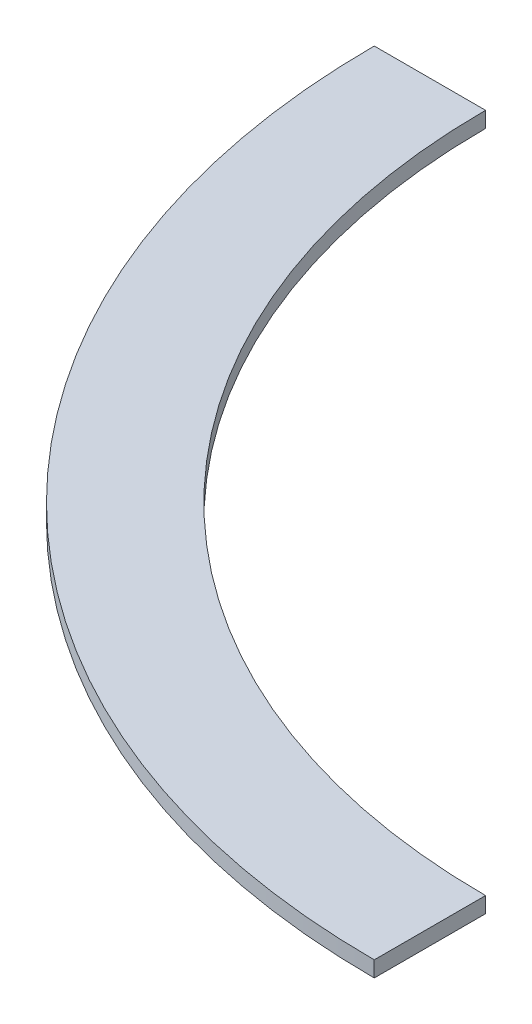
ISO-10303-21;
HEADER;
FILE_DESCRIPTION(('STEP AP214'),'2;1');
FILE_NAME('part.step','',(''),(''),'','','');
FILE_SCHEMA(('AUTOMOTIVE_DESIGN { 1 0 10303 214 1 1 1 1 }'));
ENDSEC;
DATA;
#1=APPLICATION_CONTEXT('core data for automotive mechanical design processes');
#2=APPLICATION_PROTOCOL_DEFINITION('international standard','automotive_design',2000,#1);
#3=PRODUCT_CONTEXT('',#1,'mechanical');
#4=PRODUCT('Part','Part','',(#3));
#5=PRODUCT_RELATED_PRODUCT_CATEGORY('part','',(#4));
#6=PRODUCT_DEFINITION_FORMATION('','',#4);
#7=PRODUCT_DEFINITION_CONTEXT('part definition',#1,'design');
#8=PRODUCT_DEFINITION('design','',#6,#7);
#9=PRODUCT_DEFINITION_SHAPE('','',#8);
#10=(LENGTH_UNIT() NAMED_UNIT(*) SI_UNIT(.MILLI.,.METRE.));
#11=(NAMED_UNIT(*) PLANE_ANGLE_UNIT() SI_UNIT($,.RADIAN.));
#12=(NAMED_UNIT(*) SI_UNIT($,.STERADIAN.) SOLID_ANGLE_UNIT());
#13=UNCERTAINTY_MEASURE_WITH_UNIT(LENGTH_MEASURE(1.E-05),#10,'distance_accuracy_value','');
#14=(GEOMETRIC_REPRESENTATION_CONTEXT(3) GLOBAL_UNCERTAINTY_ASSIGNED_CONTEXT((#13)) GLOBAL_UNIT_ASSIGNED_CONTEXT((#10,
#11,#12)) REPRESENTATION_CONTEXT('',''));
#15=CARTESIAN_POINT('',(0.,0.,0.));
#16=DIRECTION('',(0.,0.,1.));
#17=DIRECTION('',(1.,0.,0.));
#18=AXIS2_PLACEMENT_3D('',#15,#16,#17);
#19=CARTESIAN_POINT('',(0.,7.9375,0.));
#20=DIRECTION('',(0.,-1.,0.));
#21=DIRECTION('',(0.,0.,-1.));
#22=AXIS2_PLACEMENT_3D('',#19,#20,#21);
#23=CYLINDRICAL_SURFACE('',#22,342.9635);
#24=CARTESIAN_POINT('',(0.,0.,0.));
#25=DIRECTION('',(0.,1.,0.));
#26=DIRECTION('',(0.,0.,1.));
#27=AXIS2_PLACEMENT_3D('',#24,#25,#26);
#28=CIRCLE('',#27,342.9635);
#29=CARTESIAN_POINT('',(-342.9635,0.,0.));
#30=VERTEX_POINT('',#29);
#31=CARTESIAN_POINT('',(0.,0.,342.9635));
#32=VERTEX_POINT('',#31);
#33=EDGE_CURVE('E104',#30,#32,#28,.T.);
#34=ORIENTED_EDGE('',*,*,#33,.F.);
#35=DIRECTION('',(0.,-1.,0.));
#36=VECTOR('',#35,1.);
#37=CARTESIAN_POINT('',(-342.9635,7.9375,0.));
#38=LINE('',#37,#36);
#39=CARTESIAN_POINT('',(-342.9635,7.9375,0.));
#40=VERTEX_POINT('',#39);
#41=EDGE_CURVE('E11',#40,#30,#38,.T.);
#42=ORIENTED_EDGE('',*,*,#41,.F.);
#43=CARTESIAN_POINT('',(0.,7.9375,0.));
#44=DIRECTION('',(0.,1.,0.));
#45=DIRECTION('',(0.,0.,1.));
#46=AXIS2_PLACEMENT_3D('',#43,#44,#45);
#47=CIRCLE('',#46,342.9635);
#48=CARTESIAN_POINT('',(0.,7.9375,342.9635));
#49=VERTEX_POINT('',#48);
#50=EDGE_CURVE('E89',#40,#49,#47,.T.);
#51=ORIENTED_EDGE('',*,*,#50,.T.);
#52=DIRECTION('',(0.,-1.,0.));
#53=VECTOR('',#52,1.);
#54=CARTESIAN_POINT('',(0.,7.9375,342.9635));
#55=LINE('',#54,#53);
#56=EDGE_CURVE('E57',#49,#32,#55,.T.);
#57=ORIENTED_EDGE('',*,*,#56,.T.);
#58=EDGE_LOOP('',(#34,#42,#51,#57));
#59=FACE_BOUND('',#58,.T.);
#60=ADVANCED_FACE('F41',(#59),#23,.F.);
#61=CARTESIAN_POINT('',(0.,7.9375,0.));
#62=DIRECTION('',(0.,0.,1.));
#63=DIRECTION('',(1.,0.,0.));
#64=AXIS2_PLACEMENT_3D('',#61,#62,#63);
#65=PLANE('',#64);
#66=DIRECTION('',(-1.,0.,0.));
#67=VECTOR('',#66,1.);
#68=CARTESIAN_POINT('',(0.,0.,0.));
#69=LINE('',#68,#67);
#70=CARTESIAN_POINT('',(-399.0975,0.,0.));
#71=VERTEX_POINT('',#70);
#72=EDGE_CURVE('E95',#30,#71,#69,.T.);
#73=ORIENTED_EDGE('',*,*,#72,.T.);
#74=DIRECTION('',(0.,-1.,0.));
#75=VECTOR('',#74,1.);
#76=CARTESIAN_POINT('',(-399.0975,7.9375,0.));
#77=LINE('',#76,#75);
#78=CARTESIAN_POINT('',(-399.0975,7.9375,0.));
#79=VERTEX_POINT('',#78);
#80=EDGE_CURVE('E49',#79,#71,#77,.T.);
#81=ORIENTED_EDGE('',*,*,#80,.F.);
#82=DIRECTION('',(-1.,0.,0.));
#83=VECTOR('',#82,1.);
#84=CARTESIAN_POINT('',(0.,7.9375,0.));
#85=LINE('',#84,#83);
#86=EDGE_CURVE('E83',#40,#79,#85,.T.);
#87=ORIENTED_EDGE('',*,*,#86,.F.);
#88=ORIENTED_EDGE('',*,*,#41,.T.);
#89=EDGE_LOOP('',(#73,#81,#87,#88));
#90=FACE_BOUND('',#89,.T.);
#91=ADVANCED_FACE('F93',(#90),#65,.F.);
#92=CARTESIAN_POINT('',(0.,7.9375,0.));
#93=DIRECTION('',(0.,-1.,0.));
#94=DIRECTION('',(0.,0.,-1.));
#95=AXIS2_PLACEMENT_3D('',#92,#93,#94);
#96=CYLINDRICAL_SURFACE('',#95,399.0975);
#97=CARTESIAN_POINT('',(0.,0.,0.));
#98=DIRECTION('',(0.,1.,0.));
#99=DIRECTION('',(0.,0.,1.));
#100=AXIS2_PLACEMENT_3D('',#97,#98,#99);
#101=CIRCLE('',#100,399.0975);
#102=CARTESIAN_POINT('',(0.,0.,399.0975));
#103=VERTEX_POINT('',#102);
#104=EDGE_CURVE('E107',#71,#103,#101,.T.);
#105=ORIENTED_EDGE('',*,*,#104,.T.);
#106=DIRECTION('',(0.,-1.,0.));
#107=VECTOR('',#106,1.);
#108=CARTESIAN_POINT('',(0.,7.9375,399.0975));
#109=LINE('',#108,#107);
#110=CARTESIAN_POINT('',(0.,7.9375,399.0975));
#111=VERTEX_POINT('',#110);
#112=EDGE_CURVE('E71',#111,#103,#109,.T.);
#113=ORIENTED_EDGE('',*,*,#112,.F.);
#114=CARTESIAN_POINT('',(0.,7.9375,0.));
#115=DIRECTION('',(0.,1.,0.));
#116=DIRECTION('',(0.,0.,1.));
#117=AXIS2_PLACEMENT_3D('',#114,#115,#116);
#118=CIRCLE('',#117,399.0975);
#119=EDGE_CURVE('E88',#79,#111,#118,.T.);
#120=ORIENTED_EDGE('',*,*,#119,.F.);
#121=ORIENTED_EDGE('',*,*,#80,.T.);
#122=EDGE_LOOP('',(#105,#113,#120,#121));
#123=FACE_BOUND('',#122,.T.);
#124=ADVANCED_FACE('F98',(#123),#96,.T.);
#125=CARTESIAN_POINT('',(0.,7.9375,0.));
#126=DIRECTION('',(1.,0.,0.));
#127=DIRECTION('',(0.,0.,-1.));
#128=AXIS2_PLACEMENT_3D('',#125,#126,#127);
#129=PLANE('',#128);
#130=DIRECTION('',(0.,0.,1.));
#131=VECTOR('',#130,1.);
#132=CARTESIAN_POINT('',(0.,0.,0.));
#133=LINE('',#132,#131);
#134=EDGE_CURVE('E109',#32,#103,#133,.T.);
#135=ORIENTED_EDGE('',*,*,#134,.F.);
#136=ORIENTED_EDGE('',*,*,#56,.F.);
#137=DIRECTION('',(0.,0.,1.));
#138=VECTOR('',#137,1.);
#139=CARTESIAN_POINT('',(0.,7.9375,0.));
#140=LINE('',#139,#138);
#141=EDGE_CURVE('E99',#49,#111,#140,.T.);
#142=ORIENTED_EDGE('',*,*,#141,.T.);
#143=ORIENTED_EDGE('',*,*,#112,.T.);
#144=EDGE_LOOP('',(#135,#136,#142,#143));
#145=FACE_BOUND('',#144,.T.);
#146=ADVANCED_FACE('F114',(#145),#129,.T.);
#147=CARTESIAN_POINT('',(0.,7.9375,0.));
#148=DIRECTION('',(0.,1.,0.));
#149=DIRECTION('',(0.,0.,1.));
#150=AXIS2_PLACEMENT_3D('',#147,#148,#149);
#151=PLANE('',#150);
#152=ORIENTED_EDGE('',*,*,#50,.F.);
#153=ORIENTED_EDGE('',*,*,#86,.T.);
#154=ORIENTED_EDGE('',*,*,#119,.T.);
#155=ORIENTED_EDGE('',*,*,#141,.F.);
#156=EDGE_LOOP('',(#152,#153,#154,#155));
#157=FACE_BOUND('',#156,.T.);
#158=ADVANCED_FACE('F85',(#157),#151,.T.);
#159=CARTESIAN_POINT('',(0.,0.,0.));
#160=DIRECTION('',(0.,1.,0.));
#161=DIRECTION('',(0.,0.,1.));
#162=AXIS2_PLACEMENT_3D('',#159,#160,#161);
#163=PLANE('',#162);
#164=ORIENTED_EDGE('',*,*,#33,.T.);
#165=ORIENTED_EDGE('',*,*,#134,.T.);
#166=ORIENTED_EDGE('',*,*,#104,.F.);
#167=ORIENTED_EDGE('',*,*,#72,.F.);
#168=EDGE_LOOP('',(#164,#165,#166,#167));
#169=FACE_BOUND('',#168,.T.);
#170=ADVANCED_FACE('F121',(#169),#163,.F.);
#171=CLOSED_SHELL('',(#60,#91,#124,#146,#158,#170));
#172=MANIFOLD_SOLID_BREP('B2',#171);
#173=ADVANCED_BREP_SHAPE_REPRESENTATION('',(#18,#172),#14);
#174=SHAPE_DEFINITION_REPRESENTATION(#9,#173);
ENDSEC;
END-ISO-10303-21;
